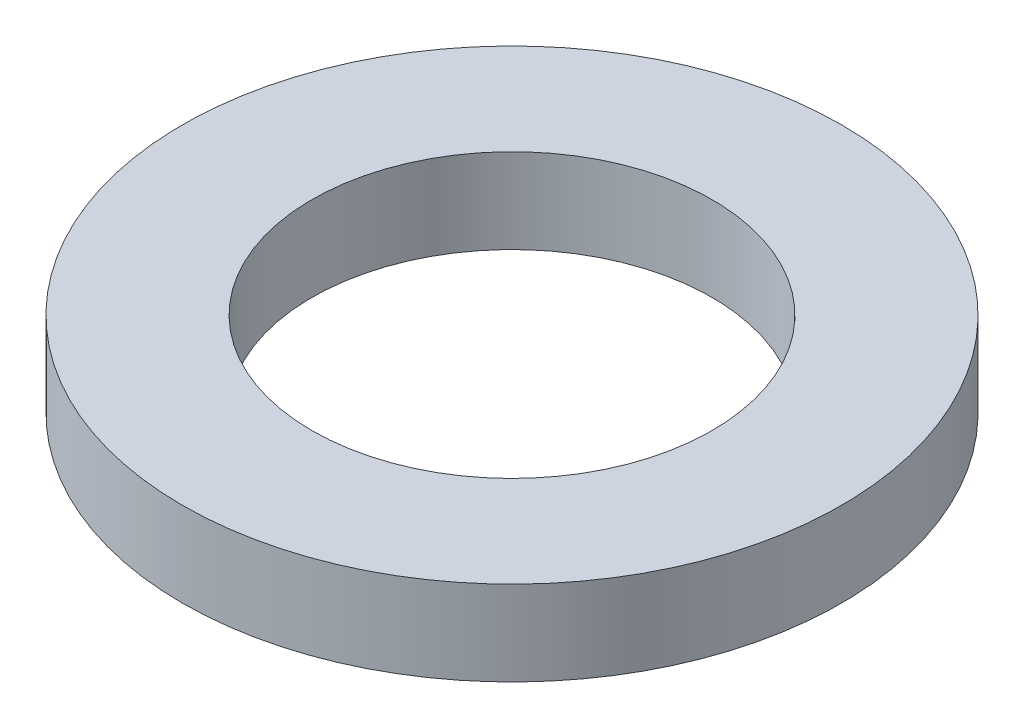
ISO-10303-21;
HEADER;
FILE_DESCRIPTION(('STEP AP214'),'2;1');
FILE_NAME('part.step','',(''),(''),'','','');
FILE_SCHEMA(('AUTOMOTIVE_DESIGN { 1 0 10303 214 1 1 1 1 }'));
ENDSEC;
DATA;
#1=APPLICATION_CONTEXT('core data for automotive mechanical design processes');
#2=APPLICATION_PROTOCOL_DEFINITION('international standard','automotive_design',2000,#1);
#3=PRODUCT_CONTEXT('',#1,'mechanical');
#4=PRODUCT('Part','Part','',(#3));
#5=PRODUCT_RELATED_PRODUCT_CATEGORY('part','',(#4));
#6=PRODUCT_DEFINITION_FORMATION('','',#4);
#7=PRODUCT_DEFINITION_CONTEXT('part definition',#1,'design');
#8=PRODUCT_DEFINITION('design','',#6,#7);
#9=PRODUCT_DEFINITION_SHAPE('','',#8);
#10=(LENGTH_UNIT() NAMED_UNIT(*) SI_UNIT(.MILLI.,.METRE.));
#11=(NAMED_UNIT(*) PLANE_ANGLE_UNIT() SI_UNIT($,.RADIAN.));
#12=(NAMED_UNIT(*) SI_UNIT($,.STERADIAN.) SOLID_ANGLE_UNIT());
#13=UNCERTAINTY_MEASURE_WITH_UNIT(LENGTH_MEASURE(1.E-05),#10,'distance_accuracy_value','');
#14=(GEOMETRIC_REPRESENTATION_CONTEXT(3) GLOBAL_UNCERTAINTY_ASSIGNED_CONTEXT((#13)) GLOBAL_UNIT_ASSIGNED_CONTEXT((#10,
#11,#12)) REPRESENTATION_CONTEXT('',''));
#15=CARTESIAN_POINT('',(0.,0.,0.));
#16=DIRECTION('',(0.,0.,1.));
#17=DIRECTION('',(1.,0.,0.));
#18=AXIS2_PLACEMENT_3D('',#15,#16,#17);
#19=CARTESIAN_POINT('',(0.,1.8,0.));
#20=DIRECTION('',(0.,1.,0.));
#21=DIRECTION('',(0.,0.,1.));
#22=AXIS2_PLACEMENT_3D('',#19,#20,#21);
#23=PLANE('',#22);
#24=CARTESIAN_POINT('',(0.,1.8,0.));
#25=DIRECTION('',(0.,1.,0.));
#26=DIRECTION('',(0.,0.,1.));
#27=AXIS2_PLACEMENT_3D('',#24,#25,#26);
#28=CIRCLE('',#27,7.);
#29=CARTESIAN_POINT('',(0.,1.8,7.));
#30=VERTEX_POINT('',#29);
#31=EDGE_CURVE('E10',#30,#30,#28,.T.);
#32=ORIENTED_EDGE('',*,*,#31,.T.);
#33=EDGE_LOOP('',(#32));
#34=FACE_BOUND('',#33,.T.);
#35=CARTESIAN_POINT('',(0.,1.8,0.));
#36=DIRECTION('',(0.,1.,0.));
#37=DIRECTION('',(0.,0.,1.));
#38=AXIS2_PLACEMENT_3D('',#35,#36,#37);
#39=CIRCLE('',#38,4.25);
#40=CARTESIAN_POINT('',(0.,1.8,4.25));
#41=VERTEX_POINT('',#40);
#42=EDGE_CURVE('E52',#41,#41,#39,.T.);
#43=ORIENTED_EDGE('',*,*,#42,.F.);
#44=EDGE_LOOP('',(#43));
#45=FACE_BOUND('',#44,.T.);
#46=ADVANCED_FACE('F39',(#34,#45),#23,.T.);
#47=CARTESIAN_POINT('',(0.,0.,0.));
#48=DIRECTION('',(0.,1.,0.));
#49=DIRECTION('',(0.,0.,1.));
#50=AXIS2_PLACEMENT_3D('',#47,#48,#49);
#51=PLANE('',#50);
#52=CARTESIAN_POINT('',(0.,0.,0.));
#53=DIRECTION('',(0.,1.,0.));
#54=DIRECTION('',(0.,0.,1.));
#55=AXIS2_PLACEMENT_3D('',#52,#53,#54);
#56=CIRCLE('',#55,7.);
#57=CARTESIAN_POINT('',(0.,0.,7.));
#58=VERTEX_POINT('',#57);
#59=EDGE_CURVE('E43',#58,#58,#56,.T.);
#60=ORIENTED_EDGE('',*,*,#59,.F.);
#61=EDGE_LOOP('',(#60));
#62=FACE_BOUND('',#61,.T.);
#63=CARTESIAN_POINT('',(0.,0.,0.));
#64=DIRECTION('',(0.,1.,0.));
#65=DIRECTION('',(0.,0.,1.));
#66=AXIS2_PLACEMENT_3D('',#63,#64,#65);
#67=CIRCLE('',#66,4.25);
#68=CARTESIAN_POINT('',(0.,0.,4.25));
#69=VERTEX_POINT('',#68);
#70=EDGE_CURVE('E54',#69,#69,#67,.T.);
#71=ORIENTED_EDGE('',*,*,#70,.T.);
#72=EDGE_LOOP('',(#71));
#73=FACE_BOUND('',#72,.T.);
#74=ADVANCED_FACE('F66',(#62,#73),#51,.F.);
#75=CARTESIAN_POINT('',(0.,1.8,0.));
#76=DIRECTION('',(0.,-1.,0.));
#77=DIRECTION('',(0.,0.,-1.));
#78=AXIS2_PLACEMENT_3D('',#75,#76,#77);
#79=CYLINDRICAL_SURFACE('',#78,7.);
#80=ORIENTED_EDGE('',*,*,#31,.F.);
#81=EDGE_LOOP('',(#80));
#82=FACE_BOUND('',#81,.T.);
#83=ORIENTED_EDGE('',*,*,#59,.T.);
#84=EDGE_LOOP('',(#83));
#85=FACE_BOUND('',#84,.T.);
#86=ADVANCED_FACE('F41',(#82,#85),#79,.T.);
#87=CARTESIAN_POINT('',(0.,1.8,0.));
#88=DIRECTION('',(0.,-1.,0.));
#89=DIRECTION('',(0.,0.,-1.));
#90=AXIS2_PLACEMENT_3D('',#87,#88,#89);
#91=CYLINDRICAL_SURFACE('',#90,4.25);
#92=ORIENTED_EDGE('',*,*,#42,.T.);
#93=EDGE_LOOP('',(#92));
#94=FACE_BOUND('',#93,.T.);
#95=ORIENTED_EDGE('',*,*,#70,.F.);
#96=EDGE_LOOP('',(#95));
#97=FACE_BOUND('',#96,.T.);
#98=ADVANCED_FACE('F62',(#94,#97),#91,.F.);
#99=CLOSED_SHELL('',(#46,#74,#86,#98));
#100=MANIFOLD_SOLID_BREP('B2',#99);
#101=ADVANCED_BREP_SHAPE_REPRESENTATION('',(#18,#100),#14);
#102=SHAPE_DEFINITION_REPRESENTATION(#9,#101);
ENDSEC;
END-ISO-10303-21;
